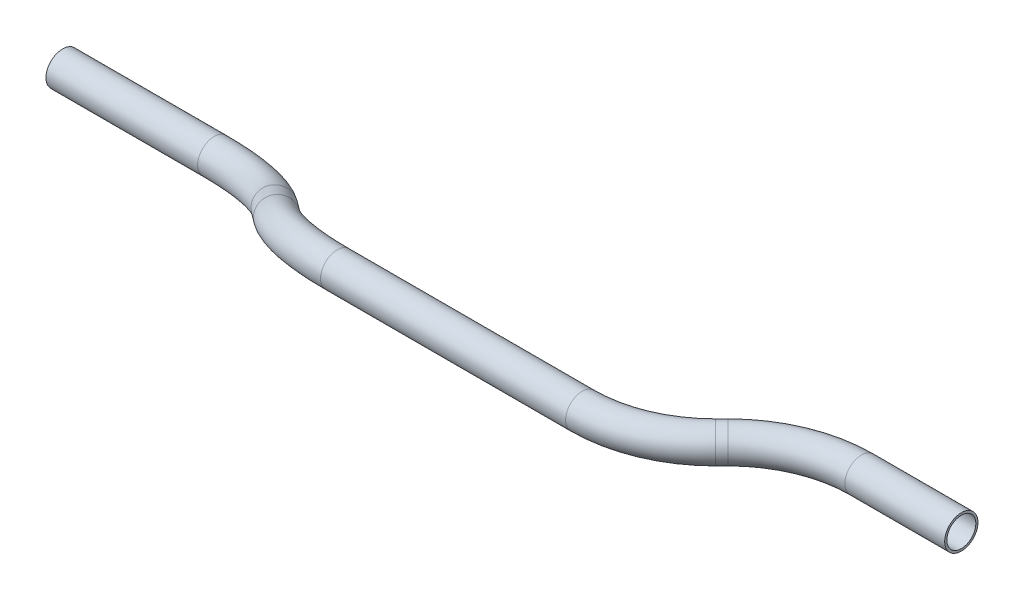
ISO-10303-21;
HEADER;
FILE_DESCRIPTION(('STEP AP214'),'2;1');
FILE_NAME('part.step','',(''),(''),'','','');
FILE_SCHEMA(('AUTOMOTIVE_DESIGN { 1 0 10303 214 1 1 1 1 }'));
ENDSEC;
DATA;
#1=APPLICATION_CONTEXT('core data for automotive mechanical design processes');
#2=APPLICATION_PROTOCOL_DEFINITION('international standard','automotive_design',2000,#1);
#3=PRODUCT_CONTEXT('',#1,'mechanical');
#4=PRODUCT('Part','Part','',(#3));
#5=PRODUCT_RELATED_PRODUCT_CATEGORY('part','',(#4));
#6=PRODUCT_DEFINITION_FORMATION('','',#4);
#7=PRODUCT_DEFINITION_CONTEXT('part definition',#1,'design');
#8=PRODUCT_DEFINITION('design','',#6,#7);
#9=PRODUCT_DEFINITION_SHAPE('','',#8);
#10=(LENGTH_UNIT() NAMED_UNIT(*) SI_UNIT(.MILLI.,.METRE.));
#11=(NAMED_UNIT(*) PLANE_ANGLE_UNIT() SI_UNIT($,.RADIAN.));
#12=(NAMED_UNIT(*) SI_UNIT($,.STERADIAN.) SOLID_ANGLE_UNIT());
#13=UNCERTAINTY_MEASURE_WITH_UNIT(LENGTH_MEASURE(1.E-05),#10,'distance_accuracy_value','');
#14=(GEOMETRIC_REPRESENTATION_CONTEXT(3) GLOBAL_UNCERTAINTY_ASSIGNED_CONTEXT((#13)) GLOBAL_UNIT_ASSIGNED_CONTEXT((#10,
#11,#12)) REPRESENTATION_CONTEXT('',''));
#15=CARTESIAN_POINT('',(0.,0.,0.));
#16=DIRECTION('',(0.,0.,1.));
#17=DIRECTION('',(1.,0.,0.));
#18=AXIS2_PLACEMENT_3D('',#15,#16,#17);
#19=CARTESIAN_POINT('',(0.,0.,0.));
#20=DIRECTION('',(1.,0.,0.));
#21=DIRECTION('',(0.,0.,-1.));
#22=AXIS2_PLACEMENT_3D('',#19,#20,#21);
#23=CYLINDRICAL_SURFACE('',#22,9.525);
#24=CARTESIAN_POINT('',(86.6755841511701,0.,0.));
#25=DIRECTION('',(1.,0.,0.));
#26=DIRECTION('',(0.,0.,-1.));
#27=AXIS2_PLACEMENT_3D('',#24,#25,#26);
#28=CIRCLE('',#27,9.525);
#29=CARTESIAN_POINT('',(86.6755841511701,-4.68373730730848,-8.29386700135268));
#30=VERTEX_POINT('',#29);
#31=EDGE_CURVE('E61',#30,#30,#28,.T.);
#32=ORIENTED_EDGE('',*,*,#31,.F.);
#33=EDGE_LOOP('',(#32));
#34=FACE_BOUND('',#33,.T.);
#35=CARTESIAN_POINT('',(0.,0.,0.));
#36=DIRECTION('',(1.,0.,0.));
#37=DIRECTION('',(0.,0.,-1.));
#38=AXIS2_PLACEMENT_3D('',#35,#36,#37);
#39=CIRCLE('',#38,9.525);
#40=CARTESIAN_POINT('',(0.,0.,-9.525));
#41=VERTEX_POINT('',#40);
#42=EDGE_CURVE('E58',#41,#41,#39,.T.);
#43=ORIENTED_EDGE('',*,*,#42,.T.);
#44=EDGE_LOOP('',(#43));
#45=FACE_BOUND('',#44,.T.);
#46=ADVANCED_FACE('F37',(#34,#45),#23,.T.);
#47=CARTESIAN_POINT('',(86.6755841511701,37.4698984584678,66.3509360108214));
#48=DIRECTION('',(0.,-0.870747191743063,0.491730950898527));
#49=DIRECTION('',(0.,-0.491730950898527,-0.870747191743063));
#50=AXIS2_PLACEMENT_3D('',#47,#48,#49);
#51=TOROIDAL_SURFACE('',#50,76.2,9.525);
#52=CARTESIAN_POINT('',(140.557120877585,10.9746791681139,19.4337392194949));
#53=DIRECTION('',(0.707106781186547,0.347706289899658,0.615711243980663));
#54=DIRECTION('',(0.615711243980663,0.125409069106512,-0.777928164692359));
#55=AXIS2_PLACEMENT_3D('',#52,#53,#54);
#56=CIRCLE('',#55,9.525);
#57=CARTESIAN_POINT('',(147.292312968387,7.66277675681963,13.5690896205791));
#58=VERTEX_POINT('',#57);
#59=EDGE_CURVE('E64',#58,#58,#56,.T.);
#60=CARTESIAN_POINT('',(86.6755841511701,37.4698984584678,66.3509360108214));
#61=DIRECTION('',(0.,-0.870747191743063,0.491730950898527));
#62=DIRECTION('',(0.,-0.491730950898527,-0.870747191743063));
#63=AXIS2_PLACEMENT_3D('',#60,#61,#62);
#64=CIRCLE('',#63,85.725);
#65=EDGE_CURVE('',#30,#58,#64,.T.);
#66=ORIENTED_EDGE('',*,*,#31,.T.);
#67=ORIENTED_EDGE('',*,*,#59,.F.);
#68=ORIENTED_EDGE('',*,*,#65,.T.);
#69=ORIENTED_EDGE('',*,*,#65,.F.);
#70=EDGE_LOOP('',(#66,#68,#67,#69));
#71=FACE_BOUND('',#70,.T.);
#72=ADVANCED_FACE('F121',(#71),#51,.T.);
#73=CARTESIAN_POINT('',(140.557120877585,10.9746791681139,19.4337392194949));
#74=DIRECTION('',(0.707106781186547,0.347706289899658,0.615711243980663));
#75=DIRECTION('',(0.656686157330899,0.,-0.754163968093131));
#76=AXIS2_PLACEMENT_3D('',#73,#74,#75);
#77=CYLINDRICAL_SURFACE('',#76,9.525);
#78=CARTESIAN_POINT('',(151.34385857835,16.2788519548041,28.8262607805051));
#79=DIRECTION('',(0.707106781186547,0.347706289899658,0.615711243980663));
#80=DIRECTION('',(0.615711243980663,0.125409069106512,-0.777928164692359));
#81=AXIS2_PLACEMENT_3D('',#78,#79,#80);
#82=CIRCLE('',#81,9.525);
#83=CARTESIAN_POINT('',(144.608666487548,19.5907543660983,34.6909103794209));
#84=VERTEX_POINT('',#83);
#85=EDGE_CURVE('E67',#84,#84,#82,.T.);
#86=ORIENTED_EDGE('',*,*,#85,.F.);
#87=EDGE_LOOP('',(#86));
#88=FACE_BOUND('',#87,.T.);
#89=ORIENTED_EDGE('',*,*,#59,.T.);
#90=EDGE_LOOP('',(#89));
#91=FACE_BOUND('',#90,.T.);
#92=ADVANCED_FACE('F125',(#88,#91),#77,.T.);
#93=CARTESIAN_POINT('',(205.225395304765,-10.2163673355499,-18.0909360108214));
#94=DIRECTION('',(0.,0.870747191743063,-0.491730950898527));
#95=DIRECTION('',(0.,0.491730950898527,0.870747191743063));
#96=AXIS2_PLACEMENT_3D('',#93,#94,#95);
#97=TOROIDAL_SURFACE('',#96,76.2,9.525);
#98=CARTESIAN_POINT('',(205.225395304765,27.2535311229179,48.26));
#99=DIRECTION('',(1.,0.,0.));
#100=DIRECTION('',(0.,0.,-1.));
#101=AXIS2_PLACEMENT_3D('',#98,#99,#100);
#102=CIRCLE('',#101,9.525);
#103=CARTESIAN_POINT('',(205.225395304765,31.9372684302264,56.5538670013527));
#104=VERTEX_POINT('',#103);
#105=EDGE_CURVE('E70',#104,#104,#102,.T.);
#106=CARTESIAN_POINT('',(205.225395304765,-10.2163673355499,-18.0909360108214));
#107=DIRECTION('',(0.,0.870747191743063,-0.491730950898527));
#108=DIRECTION('',(0.,0.491730950898527,0.870747191743063));
#109=AXIS2_PLACEMENT_3D('',#106,#107,#108);
#110=CIRCLE('',#109,85.725);
#111=EDGE_CURVE('',#84,#104,#110,.T.);
#112=ORIENTED_EDGE('',*,*,#85,.T.);
#113=ORIENTED_EDGE('',*,*,#105,.F.);
#114=ORIENTED_EDGE('',*,*,#111,.T.);
#115=ORIENTED_EDGE('',*,*,#111,.F.);
#116=EDGE_LOOP('',(#112,#114,#113,#115));
#117=FACE_BOUND('',#116,.T.);
#118=ADVANCED_FACE('F129',(#117),#97,.T.);
#119=CARTESIAN_POINT('',(205.225395304765,27.2535311229179,48.26));
#120=DIRECTION('',(1.,0.,0.));
#121=DIRECTION('',(0.,1.,0.));
#122=AXIS2_PLACEMENT_3D('',#119,#120,#121);
#123=CYLINDRICAL_SURFACE('',#122,9.525);
#124=CARTESIAN_POINT('',(345.299248399105,27.2535311229179,48.26));
#125=DIRECTION('',(1.,0.,0.));
#126=DIRECTION('',(0.,0.,-1.));
#127=AXIS2_PLACEMENT_3D('',#124,#125,#126);
#128=CIRCLE('',#127,9.525);
#129=CARTESIAN_POINT('',(345.299248399105,27.2535311229179,57.785));
#130=VERTEX_POINT('',#129);
#131=EDGE_CURVE('E73',#130,#130,#128,.T.);
#132=ORIENTED_EDGE('',*,*,#131,.F.);
#133=EDGE_LOOP('',(#132));
#134=FACE_BOUND('',#133,.T.);
#135=ORIENTED_EDGE('',*,*,#105,.T.);
#136=EDGE_LOOP('',(#135));
#137=FACE_BOUND('',#136,.T.);
#138=ADVANCED_FACE('F133',(#134,#137),#123,.T.);
#139=CARTESIAN_POINT('',(345.299248399105,27.2535311229179,-27.94));
#140=DIRECTION('',(0.,1.,0.));
#141=DIRECTION('',(0.,0.,1.));
#142=AXIS2_PLACEMENT_3D('',#139,#140,#141);
#143=TOROIDAL_SURFACE('',#142,76.2,9.525);
#144=CARTESIAN_POINT('',(399.18078512552,27.2535311229179,25.9415367264147));
#145=DIRECTION('',(0.707106781186545,0.,-0.70710678118655));
#146=DIRECTION('',(-0.70710678118655,0.,-0.707106781186545));
#147=AXIS2_PLACEMENT_3D('',#144,#145,#146);
#148=CIRCLE('',#147,9.525);
#149=CARTESIAN_POINT('',(405.915977216322,27.2535311229179,32.6767288172166));
#150=VERTEX_POINT('',#149);
#151=EDGE_CURVE('E76',#150,#150,#148,.T.);
#152=CARTESIAN_POINT('',(345.299248399105,27.2535311229179,-27.94));
#153=DIRECTION('',(0.,1.,0.));
#154=DIRECTION('',(0.,0.,1.));
#155=AXIS2_PLACEMENT_3D('',#152,#153,#154);
#156=CIRCLE('',#155,85.725);
#157=EDGE_CURVE('',#130,#150,#156,.T.);
#158=ORIENTED_EDGE('',*,*,#131,.T.);
#159=ORIENTED_EDGE('',*,*,#151,.F.);
#160=ORIENTED_EDGE('',*,*,#157,.T.);
#161=ORIENTED_EDGE('',*,*,#157,.F.);
#162=EDGE_LOOP('',(#158,#160,#159,#161));
#163=FACE_BOUND('',#162,.T.);
#164=ADVANCED_FACE('F95',(#163),#143,.T.);
#165=CARTESIAN_POINT('',(399.18078512552,27.2535311229179,25.9415367264147));
#166=DIRECTION('',(0.707106781186544,0.,-0.707106781186551));
#167=DIRECTION('',(-0.707106781186551,0.,-0.707106781186544));
#168=AXIS2_PLACEMENT_3D('',#165,#166,#167);
#169=CYLINDRICAL_SURFACE('',#168,9.525);
#170=CARTESIAN_POINT('',(402.80385857835,27.2535311229179,22.3184632735853));
#171=DIRECTION('',(0.707106781186544,0.,-0.707106781186551));
#172=DIRECTION('',(-0.707106781186551,0.,-0.707106781186544));
#173=AXIS2_PLACEMENT_3D('',#170,#171,#172);
#174=CIRCLE('',#173,9.525);
#175=CARTESIAN_POINT('',(396.068666487548,27.2535311229179,15.5832711827834));
#176=VERTEX_POINT('',#175);
#177=EDGE_CURVE('E78',#176,#176,#174,.T.);
#178=ORIENTED_EDGE('',*,*,#177,.F.);
#179=EDGE_LOOP('',(#178));
#180=FACE_BOUND('',#179,.T.);
#181=ORIENTED_EDGE('',*,*,#151,.T.);
#182=EDGE_LOOP('',(#181));
#183=FACE_BOUND('',#182,.T.);
#184=ADVANCED_FACE('F88',(#180,#183),#169,.T.);
#185=CARTESIAN_POINT('',(456.685395304765,27.2535311229179,76.2));
#186=DIRECTION('',(0.,-1.,0.));
#187=DIRECTION('',(0.,0.,-1.));
#188=AXIS2_PLACEMENT_3D('',#185,#186,#187);
#189=TOROIDAL_SURFACE('',#188,76.2,9.525);
#190=CARTESIAN_POINT('',(456.685395304765,27.2535311229179,0.));
#191=DIRECTION('',(1.,0.,0.));
#192=DIRECTION('',(0.,0.,-1.));
#193=AXIS2_PLACEMENT_3D('',#190,#191,#192);
#194=CIRCLE('',#193,9.525);
#195=CARTESIAN_POINT('',(456.685395304765,27.2535311229179,-9.52499999999998));
#196=VERTEX_POINT('',#195);
#197=EDGE_CURVE('E41',#196,#196,#194,.T.);
#198=CARTESIAN_POINT('',(456.685395304765,27.2535311229179,76.2));
#199=DIRECTION('',(0.,-1.,0.));
#200=DIRECTION('',(0.,0.,-1.));
#201=AXIS2_PLACEMENT_3D('',#198,#199,#200);
#202=CIRCLE('',#201,85.725);
#203=EDGE_CURVE('',#176,#196,#202,.T.);
#204=ORIENTED_EDGE('',*,*,#177,.T.);
#205=ORIENTED_EDGE('',*,*,#197,.F.);
#206=ORIENTED_EDGE('',*,*,#203,.T.);
#207=ORIENTED_EDGE('',*,*,#203,.F.);
#208=EDGE_LOOP('',(#204,#206,#205,#207));
#209=FACE_BOUND('',#208,.T.);
#210=ADVANCED_FACE('F86',(#209),#189,.T.);
#211=CARTESIAN_POINT('',(456.685395304765,27.2535311229179,0.));
#212=DIRECTION('',(1.,0.,0.));
#213=DIRECTION('',(0.,0.,-1.));
#214=AXIS2_PLACEMENT_3D('',#211,#212,#213);
#215=CYLINDRICAL_SURFACE('',#214,9.525);
#216=CARTESIAN_POINT('',(513.775796055935,27.2535311229179,0.));
#217=DIRECTION('',(1.,0.,0.));
#218=DIRECTION('',(0.,0.,-1.));
#219=AXIS2_PLACEMENT_3D('',#216,#217,#218);
#220=CIRCLE('',#219,9.525);
#221=CARTESIAN_POINT('',(513.775796055935,27.2535311229179,-9.525));
#222=VERTEX_POINT('',#221);
#223=EDGE_CURVE('E54',#222,#222,#220,.T.);
#224=ORIENTED_EDGE('',*,*,#223,.F.);
#225=EDGE_LOOP('',(#224));
#226=FACE_BOUND('',#225,.T.);
#227=ORIENTED_EDGE('',*,*,#197,.T.);
#228=EDGE_LOOP('',(#227));
#229=FACE_BOUND('',#228,.T.);
#230=ADVANCED_FACE('F39',(#226,#229),#215,.T.);
#231=CARTESIAN_POINT('',(0.,0.,0.));
#232=DIRECTION('',(1.,0.,0.));
#233=DIRECTION('',(0.,0.,-1.));
#234=AXIS2_PLACEMENT_3D('',#231,#232,#233);
#235=PLANE('',#234);
#236=CARTESIAN_POINT('',(0.,0.,0.));
#237=DIRECTION('',(1.,0.,0.));
#238=DIRECTION('',(0.,0.,-1.));
#239=AXIS2_PLACEMENT_3D('',#236,#237,#238);
#240=CIRCLE('',#239,8.2804);
#241=CARTESIAN_POINT('',(0.,0.,-8.2804));
#242=VERTEX_POINT('',#241);
#243=EDGE_CURVE('E57',#242,#242,#240,.F.);
#244=ORIENTED_EDGE('',*,*,#243,.F.);
#245=EDGE_LOOP('',(#244));
#246=FACE_BOUND('',#245,.T.);
#247=ORIENTED_EDGE('',*,*,#42,.F.);
#248=EDGE_LOOP('',(#247));
#249=FACE_BOUND('',#248,.T.);
#250=ADVANCED_FACE('F93',(#246,#249),#235,.F.);
#251=CARTESIAN_POINT('',(513.775796055935,27.2535311229179,0.));
#252=DIRECTION('',(1.,0.,0.));
#253=DIRECTION('',(0.,0.,-1.));
#254=AXIS2_PLACEMENT_3D('',#251,#252,#253);
#255=PLANE('',#254);
#256=CARTESIAN_POINT('',(513.775796055935,27.2535311229179,0.));
#257=DIRECTION('',(1.,0.,0.));
#258=DIRECTION('',(0.,0.,-1.));
#259=AXIS2_PLACEMENT_3D('',#256,#257,#258);
#260=CIRCLE('',#259,8.2804);
#261=CARTESIAN_POINT('',(513.775796055935,27.2535311229179,-8.2804));
#262=VERTEX_POINT('',#261);
#263=EDGE_CURVE('E10',#262,#262,#260,.F.);
#264=ORIENTED_EDGE('',*,*,#263,.T.);
#265=EDGE_LOOP('',(#264));
#266=FACE_BOUND('',#265,.T.);
#267=ORIENTED_EDGE('',*,*,#223,.T.);
#268=EDGE_LOOP('',(#267));
#269=FACE_BOUND('',#268,.T.);
#270=ADVANCED_FACE('F112',(#266,#269),#255,.T.);
#271=CARTESIAN_POINT('',(0.,0.,0.));
#272=DIRECTION('',(1.,0.,0.));
#273=DIRECTION('',(0.,0.,-1.));
#274=AXIS2_PLACEMENT_3D('',#271,#272,#273);
#275=CYLINDRICAL_SURFACE('',#274,8.2804);
#276=CARTESIAN_POINT('',(86.6755841511701,0.,0.));
#277=DIRECTION('',(1.,0.,0.));
#278=DIRECTION('',(0.,0.,-1.));
#279=AXIS2_PLACEMENT_3D('',#276,#277,#278);
#280=CIRCLE('',#279,8.2804);
#281=CARTESIAN_POINT('',(86.6755841511701,-4.07172896582017,-7.21013504650926));
#282=VERTEX_POINT('',#281);
#283=EDGE_CURVE('E286',#282,#282,#280,.F.);
#284=ORIENTED_EDGE('',*,*,#283,.F.);
#285=EDGE_LOOP('',(#284));
#286=FACE_BOUND('',#285,.T.);
#287=ORIENTED_EDGE('',*,*,#243,.T.);
#288=EDGE_LOOP('',(#287));
#289=FACE_BOUND('',#288,.T.);
#290=ADVANCED_FACE('F115',(#286,#289),#275,.F.);
#291=CARTESIAN_POINT('',(86.6755841511701,37.4698984584678,66.3509360108214));
#292=DIRECTION('',(0.,-0.870747191743063,0.491730950898527));
#293=DIRECTION('',(0.,-0.491730950898527,-0.870747191743063));
#294=AXIS2_PLACEMENT_3D('',#291,#292,#293);
#295=TOROIDAL_SURFACE('',#294,76.2,8.2804);
#296=CARTESIAN_POINT('',(140.557120877585,10.9746791681139,19.4337392194949));
#297=DIRECTION('',(0.707106781186547,0.347706289899658,0.615711243980663));
#298=DIRECTION('',(0.615711243980663,0.125409069106512,-0.777928164692359));
#299=AXIS2_PLACEMENT_3D('',#296,#297,#298);
#300=CIRCLE('',#299,8.2804);
#301=CARTESIAN_POINT('',(146.412247868522,8.09553200522874,14.3354038348374));
#302=VERTEX_POINT('',#301);
#303=EDGE_CURVE('E283',#302,#302,#300,.F.);
#304=CARTESIAN_POINT('',(86.6755841511701,37.4698984584678,66.3509360108214));
#305=DIRECTION('',(0.,-0.870747191743063,0.491730950898527));
#306=DIRECTION('',(0.,-0.491730950898527,-0.870747191743063));
#307=AXIS2_PLACEMENT_3D('',#304,#305,#306);
#308=CIRCLE('',#307,84.4804);
#309=EDGE_CURVE('',#282,#302,#308,.T.);
#310=ORIENTED_EDGE('',*,*,#283,.T.);
#311=ORIENTED_EDGE('',*,*,#303,.F.);
#312=ORIENTED_EDGE('',*,*,#309,.T.);
#313=ORIENTED_EDGE('',*,*,#309,.F.);
#314=EDGE_LOOP('',(#310,#312,#311,#313));
#315=FACE_BOUND('',#314,.T.);
#316=ADVANCED_FACE('F194',(#315),#295,.F.);
#317=CARTESIAN_POINT('',(140.557120877585,10.9746791681139,19.4337392194949));
#318=DIRECTION('',(0.707106781186547,0.347706289899658,0.615711243980663));
#319=DIRECTION('',(0.656686157330899,0.,-0.754163968093131));
#320=AXIS2_PLACEMENT_3D('',#317,#318,#319);
#321=CYLINDRICAL_SURFACE('',#320,8.2804);
#322=CARTESIAN_POINT('',(151.34385857835,16.2788519548041,28.8262607805051));
#323=DIRECTION('',(0.707106781186547,0.347706289899658,0.615711243980663));
#324=DIRECTION('',(0.615711243980663,0.125409069106512,-0.777928164692359));
#325=AXIS2_PLACEMENT_3D('',#322,#323,#324);
#326=CIRCLE('',#325,8.2804);
#327=CARTESIAN_POINT('',(145.488731587413,19.1579991176892,33.9245961651626));
#328=VERTEX_POINT('',#327);
#329=EDGE_CURVE('E280',#328,#328,#326,.F.);
#330=ORIENTED_EDGE('',*,*,#329,.F.);
#331=EDGE_LOOP('',(#330));
#332=FACE_BOUND('',#331,.T.);
#333=ORIENTED_EDGE('',*,*,#303,.T.);
#334=EDGE_LOOP('',(#333));
#335=FACE_BOUND('',#334,.T.);
#336=ADVANCED_FACE('F204',(#332,#335),#321,.F.);
#337=CARTESIAN_POINT('',(205.225395304765,-10.2163673355499,-18.0909360108214));
#338=DIRECTION('',(0.,0.870747191743063,-0.491730950898527));
#339=DIRECTION('',(0.,0.491730950898527,0.870747191743063));
#340=AXIS2_PLACEMENT_3D('',#337,#338,#339);
#341=TOROIDAL_SURFACE('',#340,76.2,8.2804);
#342=CARTESIAN_POINT('',(205.225395304765,27.2535311229179,48.26));
#343=DIRECTION('',(1.,0.,0.));
#344=DIRECTION('',(0.,0.,-1.));
#345=AXIS2_PLACEMENT_3D('',#342,#343,#344);
#346=CIRCLE('',#345,8.2804);
#347=CARTESIAN_POINT('',(205.225395304765,31.3252600887381,55.4701350465093));
#348=VERTEX_POINT('',#347);
#349=EDGE_CURVE('E275',#348,#348,#346,.F.);
#350=CARTESIAN_POINT('',(205.225395304765,-10.2163673355499,-18.0909360108214));
#351=DIRECTION('',(0.,0.870747191743063,-0.491730950898527));
#352=DIRECTION('',(0.,0.491730950898527,0.870747191743063));
#353=AXIS2_PLACEMENT_3D('',#350,#351,#352);
#354=CIRCLE('',#353,84.4804);
#355=EDGE_CURVE('',#328,#348,#354,.T.);
#356=ORIENTED_EDGE('',*,*,#329,.T.);
#357=ORIENTED_EDGE('',*,*,#349,.F.);
#358=ORIENTED_EDGE('',*,*,#355,.T.);
#359=ORIENTED_EDGE('',*,*,#355,.F.);
#360=EDGE_LOOP('',(#356,#358,#357,#359));
#361=FACE_BOUND('',#360,.T.);
#362=ADVANCED_FACE('F214',(#361),#341,.F.);
#363=CARTESIAN_POINT('',(205.225395304765,27.2535311229179,48.26));
#364=DIRECTION('',(1.,0.,0.));
#365=DIRECTION('',(0.,1.,0.));
#366=AXIS2_PLACEMENT_3D('',#363,#364,#365);
#367=CYLINDRICAL_SURFACE('',#366,8.2804);
#368=CARTESIAN_POINT('',(345.299248399105,27.2535311229179,48.26));
#369=DIRECTION('',(1.,0.,0.));
#370=DIRECTION('',(0.,0.,-1.));
#371=AXIS2_PLACEMENT_3D('',#368,#369,#370);
#372=CIRCLE('',#371,8.2804);
#373=CARTESIAN_POINT('',(345.299248399105,27.2535311229179,56.5404));
#374=VERTEX_POINT('',#373);
#375=EDGE_CURVE('E272',#374,#374,#372,.F.);
#376=ORIENTED_EDGE('',*,*,#375,.F.);
#377=EDGE_LOOP('',(#376));
#378=FACE_BOUND('',#377,.T.);
#379=ORIENTED_EDGE('',*,*,#349,.T.);
#380=EDGE_LOOP('',(#379));
#381=FACE_BOUND('',#380,.T.);
#382=ADVANCED_FACE('F224',(#378,#381),#367,.F.);
#383=CARTESIAN_POINT('',(345.299248399105,27.2535311229179,-27.94));
#384=DIRECTION('',(0.,1.,0.));
#385=DIRECTION('',(0.,0.,1.));
#386=AXIS2_PLACEMENT_3D('',#383,#384,#385);
#387=TOROIDAL_SURFACE('',#386,76.2,8.2804);
#388=CARTESIAN_POINT('',(399.18078512552,27.2535311229179,25.9415367264147));
#389=DIRECTION('',(0.707106781186545,0.,-0.70710678118655));
#390=DIRECTION('',(-0.70710678118655,0.,-0.707106781186545));
#391=AXIS2_PLACEMENT_3D('',#388,#389,#390);
#392=CIRCLE('',#391,8.2804);
#393=CARTESIAN_POINT('',(405.035912116457,27.2535311229179,31.7966637173518));
#394=VERTEX_POINT('',#393);
#395=EDGE_CURVE('E271',#394,#394,#392,.F.);
#396=CARTESIAN_POINT('',(345.299248399105,27.2535311229179,-27.94));
#397=DIRECTION('',(0.,1.,0.));
#398=DIRECTION('',(0.,0.,1.));
#399=AXIS2_PLACEMENT_3D('',#396,#397,#398);
#400=CIRCLE('',#399,84.4804);
#401=EDGE_CURVE('',#374,#394,#400,.T.);
#402=ORIENTED_EDGE('',*,*,#375,.T.);
#403=ORIENTED_EDGE('',*,*,#395,.F.);
#404=ORIENTED_EDGE('',*,*,#401,.T.);
#405=ORIENTED_EDGE('',*,*,#401,.F.);
#406=EDGE_LOOP('',(#402,#404,#403,#405));
#407=FACE_BOUND('',#406,.T.);
#408=ADVANCED_FACE('F234',(#407),#387,.F.);
#409=CARTESIAN_POINT('',(399.18078512552,27.2535311229179,25.9415367264147));
#410=DIRECTION('',(0.707106781186544,0.,-0.707106781186551));
#411=DIRECTION('',(-0.707106781186551,0.,-0.707106781186544));
#412=AXIS2_PLACEMENT_3D('',#409,#410,#411);
#413=CYLINDRICAL_SURFACE('',#412,8.2804);
#414=CARTESIAN_POINT('',(402.80385857835,27.2535311229179,22.3184632735853));
#415=DIRECTION('',(0.707106781186544,0.,-0.707106781186551));
#416=DIRECTION('',(-0.707106781186551,0.,-0.707106781186544));
#417=AXIS2_PLACEMENT_3D('',#414,#415,#416);
#418=CIRCLE('',#417,8.2804);
#419=CARTESIAN_POINT('',(396.948731587413,27.2535311229179,16.4633362826482));
#420=VERTEX_POINT('',#419);
#421=EDGE_CURVE('E50',#420,#420,#418,.F.);
#422=ORIENTED_EDGE('',*,*,#421,.F.);
#423=EDGE_LOOP('',(#422));
#424=FACE_BOUND('',#423,.T.);
#425=ORIENTED_EDGE('',*,*,#395,.T.);
#426=EDGE_LOOP('',(#425));
#427=FACE_BOUND('',#426,.T.);
#428=ADVANCED_FACE('F106',(#424,#427),#413,.F.);
#429=CARTESIAN_POINT('',(456.685395304765,27.2535311229179,76.2));
#430=DIRECTION('',(0.,-1.,0.));
#431=DIRECTION('',(0.,0.,-1.));
#432=AXIS2_PLACEMENT_3D('',#429,#430,#431);
#433=TOROIDAL_SURFACE('',#432,76.2,8.2804);
#434=CARTESIAN_POINT('',(456.685395304765,27.2535311229179,0.));
#435=DIRECTION('',(1.,0.,0.));
#436=DIRECTION('',(0.,0.,-1.));
#437=AXIS2_PLACEMENT_3D('',#434,#435,#436);
#438=CIRCLE('',#437,8.2804);
#439=CARTESIAN_POINT('',(456.685395304765,27.2535311229179,-8.28039999999998));
#440=VERTEX_POINT('',#439);
#441=EDGE_CURVE('E45',#440,#440,#438,.F.);
#442=CARTESIAN_POINT('',(456.685395304765,27.2535311229179,76.2));
#443=DIRECTION('',(0.,-1.,0.));
#444=DIRECTION('',(0.,0.,-1.));
#445=AXIS2_PLACEMENT_3D('',#442,#443,#444);
#446=CIRCLE('',#445,84.4804);
#447=EDGE_CURVE('',#420,#440,#446,.T.);
#448=ORIENTED_EDGE('',*,*,#421,.T.);
#449=ORIENTED_EDGE('',*,*,#441,.F.);
#450=ORIENTED_EDGE('',*,*,#447,.T.);
#451=ORIENTED_EDGE('',*,*,#447,.F.);
#452=EDGE_LOOP('',(#448,#450,#449,#451));
#453=FACE_BOUND('',#452,.T.);
#454=ADVANCED_FACE('F100',(#453),#433,.F.);
#455=CARTESIAN_POINT('',(456.685395304765,27.2535311229179,0.));
#456=DIRECTION('',(1.,0.,0.));
#457=DIRECTION('',(0.,0.,-1.));
#458=AXIS2_PLACEMENT_3D('',#455,#456,#457);
#459=CYLINDRICAL_SURFACE('',#458,8.2804);
#460=ORIENTED_EDGE('',*,*,#263,.F.);
#461=EDGE_LOOP('',(#460));
#462=FACE_BOUND('',#461,.T.);
#463=ORIENTED_EDGE('',*,*,#441,.T.);
#464=EDGE_LOOP('',(#463));
#465=FACE_BOUND('',#464,.T.);
#466=ADVANCED_FACE('F98',(#462,#465),#459,.F.);
#467=CLOSED_SHELL('',(#46,#72,#92,#118,#138,#164,#184,#210,#230,#250,#270,#290,#316,#336,#362,
#382,#408,#428,#454,#466));
#468=MANIFOLD_SOLID_BREP('B2',#467);
#469=ADVANCED_BREP_SHAPE_REPRESENTATION('',(#18,#468),#14);
#470=SHAPE_DEFINITION_REPRESENTATION(#9,#469);
ENDSEC;
END-ISO-10303-21;
